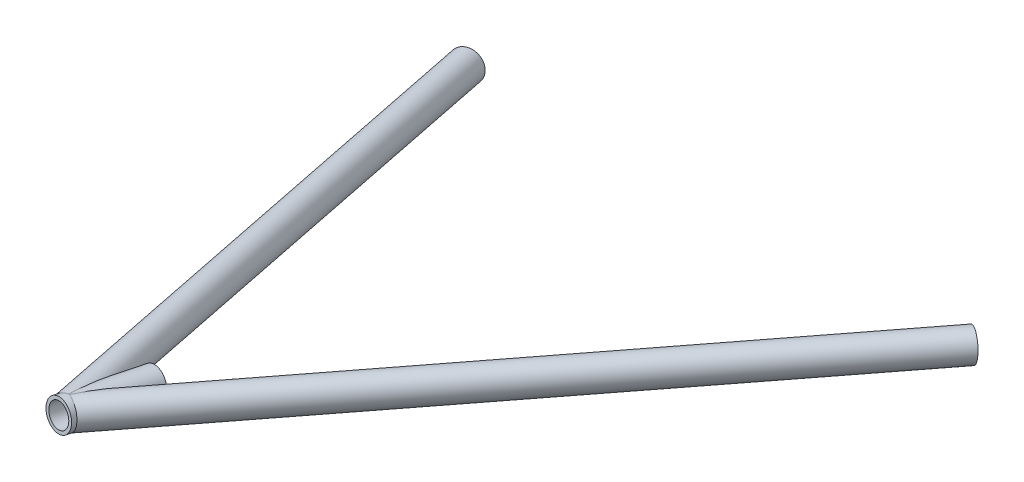
ISO-10303-21;
HEADER;
FILE_DESCRIPTION(('STEP AP214'),'2;1');
FILE_NAME('part.step','',(''),(''),'','','');
FILE_SCHEMA(('AUTOMOTIVE_DESIGN { 1 0 10303 214 1 1 1 1 }'));
ENDSEC;
DATA;
#1=APPLICATION_CONTEXT('core data for automotive mechanical design processes');
#2=APPLICATION_PROTOCOL_DEFINITION('international standard','automotive_design',2000,#1);
#3=PRODUCT_CONTEXT('',#1,'mechanical');
#4=PRODUCT('Part','Part','',(#3));
#5=PRODUCT_RELATED_PRODUCT_CATEGORY('part','',(#4));
#6=PRODUCT_DEFINITION_FORMATION('','',#4);
#7=PRODUCT_DEFINITION_CONTEXT('part definition',#1,'design');
#8=PRODUCT_DEFINITION('design','',#6,#7);
#9=PRODUCT_DEFINITION_SHAPE('','',#8);
#10=(LENGTH_UNIT() NAMED_UNIT(*) SI_UNIT(.MILLI.,.METRE.));
#11=(NAMED_UNIT(*) PLANE_ANGLE_UNIT() SI_UNIT($,.RADIAN.));
#12=(NAMED_UNIT(*) SI_UNIT($,.STERADIAN.) SOLID_ANGLE_UNIT());
#13=UNCERTAINTY_MEASURE_WITH_UNIT(LENGTH_MEASURE(1.E-05),#10,'distance_accuracy_value','');
#14=(GEOMETRIC_REPRESENTATION_CONTEXT(3) GLOBAL_UNCERTAINTY_ASSIGNED_CONTEXT((#13)) GLOBAL_UNIT_ASSIGNED_CONTEXT((#10,
#11,#12)) REPRESENTATION_CONTEXT('',''));
#15=CARTESIAN_POINT('',(0.,0.,0.));
#16=DIRECTION('',(0.,0.,1.));
#17=DIRECTION('',(1.,0.,0.));
#18=AXIS2_PLACEMENT_3D('',#15,#16,#17);
#19=CARTESIAN_POINT('',(1713.17260085528,131.13395858879,611.724588998966));
#20=DIRECTION('',(0.512976736373104,-0.08229223970805,-0.854448860508241));
#21=DIRECTION('',(-0.857356807637054,0.,-0.514722550893585));
#22=AXIS2_PLACEMENT_3D('',#19,#20,#21);
#23=CYLINDRICAL_SURFACE('',#22,7.41679999999994);
#24=CARTESIAN_POINT('',(1932.04581422694,96.022099388704,247.154513007892));
#25=DIRECTION('',(-0.512976736373104,0.0822922397080499,0.854448860508241));
#26=DIRECTION('',(0.857356807637054,0.,0.514722550893586));
#27=AXIS2_PLACEMENT_3D('',#24,#25,#26);
#28=CIRCLE('',#27,7.41679999999994);
#29=CARTESIAN_POINT('',(1938.40465819782,96.022099388704,250.972107223359));
#30=VERTEX_POINT('',#29);
#31=EDGE_CURVE('E107',#30,#30,#28,.T.);
#32=ORIENTED_EDGE('',*,*,#31,.F.);
#33=EDGE_LOOP('',(#32));
#34=FACE_BOUND('',#33,.T.);
#35=CARTESIAN_POINT('',(1727.96494727041,127.740863530205,572.676136847325));
#36=CARTESIAN_POINT('',(1727.97409356128,127.64516894431,572.660902269402));
#37=CARTESIAN_POINT('',(1727.98103211846,127.548097206245,572.652833381433));
#38=CARTESIAN_POINT('',(1727.98986205941,127.353714048548,572.652650921007));
#39=CARTESIAN_POINT('',(1727.9917570845,127.256402852634,572.660525830246));
#40=CARTESIAN_POINT('',(1727.9903865827,127.064536165254,572.692160774698));
#41=CARTESIAN_POINT('',(1727.98712459409,126.96997882967,572.715909912043));
#42=CARTESIAN_POINT('',(1727.97590682349,126.785874735888,572.777508555146));
#43=CARTESIAN_POINT('',(1727.96794614816,126.69633330799,572.81537274554));
#44=CARTESIAN_POINT('',(1727.94374603927,126.485559074002,572.921757086013));
#45=CARTESIAN_POINT('',(1727.92540545642,126.367705556888,572.996436012294));
#46=CARTESIAN_POINT('',(1727.88298827099,126.145253912992,573.162093992202));
#47=CARTESIAN_POINT('',(1727.85889597553,126.040693271732,573.253117468602));
#48=CARTESIAN_POINT('',(1727.80874896439,125.850776346686,573.438738015154));
#49=CARTESIAN_POINT('',(1727.78297627403,125.764568317802,573.532557144889));
#50=CARTESIAN_POINT('',(1727.72900511059,125.600664094481,573.726773439114));
#51=CARTESIAN_POINT('',(1727.70080438425,125.522975962023,573.827176692751));
#52=CARTESIAN_POINT('',(1727.64258111377,125.374671581661,574.032881151348));
#53=CARTESIAN_POINT('',(1727.61255461953,125.304071611508,574.138192852058));
#54=CARTESIAN_POINT('',(1727.55119302126,125.169051291257,574.352237356395));
#55=CARTESIAN_POINT('',(1727.51985847234,125.10462835719,574.460968704016));
#56=CARTESIAN_POINT('',(1727.43550937838,124.940862556696,574.75250380522));
#57=CARTESIAN_POINT('',(1727.38162646562,124.846001418485,574.937569357596));
#58=CARTESIAN_POINT('',(1727.2720160663,124.667387845638,575.312498085115));
#59=CARTESIAN_POINT('',(1727.21628751957,124.583641939115,575.502364002333));
#60=CARTESIAN_POINT('',(1727.10344674438,124.42503329062,575.885807049649));
#61=CARTESIAN_POINT('',(1727.04633202635,124.350188215227,576.079390703019));
#62=CARTESIAN_POINT('',(1726.93118633598,124.208006874476,576.469032465374));
#63=CARTESIAN_POINT('',(1726.87315525579,124.140671500554,576.665090865056));
#64=CARTESIAN_POINT('',(1726.75607151227,124.011958347827,577.060302103558));
#65=CARTESIAN_POINT('',(1726.69701473252,123.950620396564,577.259466620516));
#66=CARTESIAN_POINT('',(1726.57842016781,123.833477246945,577.659275794955));
#67=CARTESIAN_POINT('',(1726.51888236167,123.777672293717,577.859920517589));
#68=CARTESIAN_POINT('',(1726.39955647189,123.670971354545,578.262089610324));
#69=CARTESIAN_POINT('',(1726.33976888635,123.620068255865,578.463612248458));
#70=CARTESIAN_POINT('',(1726.21996664204,123.522526106761,578.867609532447));
#71=CARTESIAN_POINT('',(1726.15995198776,123.475886972416,579.070084159484));
#72=CARTESIAN_POINT('',(1725.97675549558,123.339471254847,579.68863525574));
#73=CARTESIAN_POINT('',(1725.8533478987,123.255762125754,580.105988788057));
#74=CARTESIAN_POINT('',(1725.60651921912,123.101361297342,580.943114963038));
#75=CARTESIAN_POINT('',(1725.48309813691,123.030671398123,581.362887931962));
#76=CARTESIAN_POINT('',(1725.23663397589,122.900298304971,582.204465381431));
#77=CARTESIAN_POINT('',(1725.11359110923,122.840620461465,582.626270747865));
#78=CARTESIAN_POINT('',(1724.86832131163,122.730861979163,583.471367521118));
#79=CARTESIAN_POINT('',(1724.74609440437,122.680781617954,583.894658970559));
#80=CARTESIAN_POINT('',(1724.5023773004,122.58898911596,584.744026957329));
#81=CARTESIAN_POINT('',(1724.38089135839,122.547307849537,585.170108032062));
#82=CARTESIAN_POINT('',(1724.13946845727,122.471741006267,586.023400168488));
#83=CARTESIAN_POINT('',(1724.01953151574,122.437855517866,586.450611242946));
#84=CARTESIAN_POINT('',(1723.78164336913,122.37730603995,587.305929188253));
#85=CARTESIAN_POINT('',(1723.66369146931,122.350639472405,587.734035684142));
#86=CARTESIAN_POINT('',(1723.43017032018,122.304100261973,588.591265690762));
#87=CARTESIAN_POINT('',(1723.31460107086,122.284227619046,589.020389201487));
#88=CARTESIAN_POINT('',(1723.08650301183,122.251038204343,589.879111158263));
#89=CARTESIAN_POINT('',(1722.97397051875,122.237713118719,590.308708304211));
#90=CARTESIAN_POINT('',(1722.75240223065,122.21746804288,591.168958885652));
#91=CARTESIAN_POINT('',(1722.6433664605,122.210548098208,591.599612328634));
#92=CARTESIAN_POINT('',(1722.4294841374,122.203151370928,592.462242442208));
#93=CARTESIAN_POINT('',(1722.32463967907,122.202677770736,592.894219661074));
#94=CARTESIAN_POINT('',(1722.12012673583,122.208397768749,593.759351670043));
#95=CARTESIAN_POINT('',(1722.02045816112,122.214591251234,594.192506439578));
#96=CARTESIAN_POINT('',(1721.82784497984,122.234044047694,595.058398596565));
#97=CARTESIAN_POINT('',(1721.73487583636,122.247275914712,595.49113110808));
#98=CARTESIAN_POINT('',(1721.55672743593,122.281510622887,596.357943907328));
#99=CARTESIAN_POINT('',(1721.47154880266,122.302514085519,596.792024300095));
#100=CARTESIAN_POINT('',(1721.31101479407,122.35340281984,597.661126705699));
#101=CARTESIAN_POINT('',(1721.23565138308,122.383280759445,598.096147648058));
#102=CARTESIAN_POINT('',(1721.09725075453,122.453629781079,598.967260132079));
#103=CARTESIAN_POINT('',(1721.03421072045,122.49409843764,599.40335140599));
#104=CARTESIAN_POINT('',(1720.95141843917,122.564800761776,600.058504181435));
#105=CARTESIAN_POINT('',(1720.92575512113,122.590076478741,600.27735975769));
#106=CARTESIAN_POINT('',(1720.87894799292,122.644429538069,600.715097811308));
#107=CARTESIAN_POINT('',(1720.85780430852,122.673506986186,600.933980289252));
#108=CARTESIAN_POINT('',(1720.82063639031,122.736046756599,601.37177018042));
#109=CARTESIAN_POINT('',(1720.80461691278,122.769513112292,601.590677429229));
#110=CARTESIAN_POINT('',(1720.77843177853,122.841500800809,602.0280190367));
#111=CARTESIAN_POINT('',(1720.76826600443,122.880022032265,602.246453404756));
#112=CARTESIAN_POINT('',(1720.75464236975,122.962578180945,602.680391994006));
#113=CARTESIAN_POINT('',(1720.75112283815,123.006558329871,602.895904544071));
#114=CARTESIAN_POINT('',(1720.75144146033,123.101309930987,603.32547198744));
#115=CARTESIAN_POINT('',(1720.75528034475,123.152082057095,603.539526733878));
#116=CARTESIAN_POINT('',(1720.77117314224,123.261516067903,603.964991352626));
#117=CARTESIAN_POINT('',(1720.78321484223,123.320166119178,604.176404681827));
#118=CARTESIAN_POINT('',(1720.81632130453,123.44675439699,604.595673975282));
#119=CARTESIAN_POINT('',(1720.83738269157,123.514689142633,604.803531240023));
#120=CARTESIAN_POINT('',(1720.88654176997,123.653870902915,605.193228073523));
#121=CARTESIAN_POINT('',(1720.91370135907,123.724071338384,605.375557052368));
#122=CARTESIAN_POINT('',(1720.97607889913,123.874300330305,605.734729463356));
#123=CARTESIAN_POINT('',(1721.01129627704,123.954328187649,605.911573284585));
#124=CARTESIAN_POINT('',(1721.08971062154,124.125271923741,606.258131687802));
#125=CARTESIAN_POINT('',(1721.13290784645,124.216188154927,606.427846038781));
#126=CARTESIAN_POINT('',(1721.22674446288,124.409769775465,606.758314823208));
#127=CARTESIAN_POINT('',(1721.27738376908,124.512435030114,606.919069359348));
#128=CARTESIAN_POINT('',(1721.3855072529,124.730994984514,607.23111948081));
#129=CARTESIAN_POINT('',(1721.44304636173,124.846995500896,607.382322217059));
#130=CARTESIAN_POINT('',(1721.56300771482,125.091639689068,607.67205382739));
#131=CARTESIAN_POINT('',(1721.62542999899,125.220283464155,607.810582597906));
#132=CARTESIAN_POINT('',(1721.75315143352,125.489914923755,608.073651978261));
#133=CARTESIAN_POINT('',(1721.81845111264,125.630904881767,608.19819000208));
#134=CARTESIAN_POINT('',(1721.94968124855,125.924479370239,608.432366170017));
#135=CARTESIAN_POINT('',(1722.01561167772,126.077063394983,608.542004963434));
#136=CARTESIAN_POINT('',(1722.13955526978,126.377509450479,608.736096590528));
#137=CARTESIAN_POINT('',(1722.19771779669,126.524402700009,608.821959461154));
#138=CARTESIAN_POINT('',(1722.31116511023,126.825880386425,608.981134975396));
#139=CARTESIAN_POINT('',(1722.3664501127,126.980464244723,609.054448561295));
#140=CARTESIAN_POINT('',(1722.47275540199,127.296365032461,609.188669150145));
#141=CARTESIAN_POINT('',(1722.5237749461,127.457683127195,609.249573995075));
#142=CARTESIAN_POINT('',(1722.62033165225,127.785999443879,609.359205215786));
#143=CARTESIAN_POINT('',(1722.66586857487,127.952997913477,609.407931059826));
#144=CARTESIAN_POINT('',(1722.75164172524,128.29640418743,609.494706477049));
#145=CARTESIAN_POINT('',(1722.79169181994,128.472944530114,609.532415478967));
#146=CARTESIAN_POINT('',(1722.8640371505,128.829759443344,609.595601504443));
#147=CARTESIAN_POINT('',(1722.89633232043,129.010034045622,609.621078424016));
#148=CARTESIAN_POINT('',(1722.95249148233,129.373186473069,609.660119630804));
#149=CARTESIAN_POINT('',(1722.97635454316,129.556064583422,609.673682602619));
#150=CARTESIAN_POINT('',(1723.01515818182,129.923256038395,609.689169544628));
#151=CARTESIAN_POINT('',(1723.03009848552,130.107569426933,609.691093157246));
#152=CARTESIAN_POINT('',(1723.05126111044,130.48562374927,609.68334006981));
#153=CARTESIAN_POINT('',(1723.05701489795,130.679379398514,609.673083994552));
#154=CARTESIAN_POINT('',(1723.05820730972,131.065873045047,609.640194907813));
#155=CARTESIAN_POINT('',(1723.05364558616,131.258611007804,609.617561479028));
#156=CARTESIAN_POINT('',(1723.0342649561,131.641770012805,609.560034321559));
#157=CARTESIAN_POINT('',(1723.01944390483,131.832190562108,609.525138030002));
#158=CARTESIAN_POINT('',(1722.97981103516,132.209328386555,609.443138314178));
#159=CARTESIAN_POINT('',(1722.95499922456,132.39604566459,609.396034899443));
#160=CARTESIAN_POINT('',(1722.89550269088,132.766703219176,609.288949001972));
#161=CARTESIAN_POINT('',(1722.86069983807,132.950580734236,609.22881466779));
#162=CARTESIAN_POINT('',(1722.78208849335,133.311748866658,609.095948257574));
#163=CARTESIAN_POINT('',(1722.73827986116,133.489039381357,609.023215985292));
#164=CARTESIAN_POINT('',(1722.64265698482,133.83559948493,608.865054832965));
#165=CARTESIAN_POINT('',(1722.59084362106,134.004869953218,608.779627349244));
#166=CARTESIAN_POINT('',(1722.48047464414,134.33400566275,608.595962018572));
#167=CARTESIAN_POINT('',(1722.4219192384,134.493871193108,608.497724565708));
#168=CARTESIAN_POINT('',(1722.30106472921,134.799174643532,608.290864804495));
#169=CARTESIAN_POINT('',(1722.23888720345,134.94486466322,608.18254370868));
#170=CARTESIAN_POINT('',(1722.11127512067,135.224795212031,607.953702361441));
#171=CARTESIAN_POINT('',(1722.04584064459,135.359036025404,607.833182413039));
#172=CARTESIAN_POINT('',(1721.91366635636,135.614930784771,607.580298333684));
#173=CARTESIAN_POINT('',(1721.84692756972,135.736594180956,607.447943236731));
#174=CARTESIAN_POINT('',(1721.71412450417,135.966639285091,607.171847178467));
#175=CARTESIAN_POINT('',(1721.64806018694,136.075021751086,607.02810686777));
#176=CARTESIAN_POINT('',(1721.52239851466,136.272116972746,606.738790542243));
#177=CARTESIAN_POINT('',(1721.46264865977,136.361607971169,606.593809785904));
#178=CARTESIAN_POINT('',(1721.34708030177,136.528344058238,606.295479899512));
#179=CARTESIAN_POINT('',(1721.29126195926,136.605588646783,606.142130428052));
#180=CARTESIAN_POINT('',(1721.18487097998,136.748087082032,605.828289022178));
#181=CARTESIAN_POINT('',(1721.1342967204,136.813344643017,605.667799319437));
#182=CARTESIAN_POINT('',(1721.0393136034,136.93250954249,605.340898347557));
#183=CARTESIAN_POINT('',(1720.99490558263,136.986415341279,605.174486278711));
#184=CARTESIAN_POINT('',(1720.89775755889,137.101612192386,604.774949400739));
#185=CARTESIAN_POINT('',(1720.84795468422,137.158334953547,604.539786197404));
#186=CARTESIAN_POINT('',(1720.761417646,137.254742564386,604.063646261449));
#187=CARTESIAN_POINT('',(1720.72468903258,137.294420179742,603.822667106151));
#188=CARTESIAN_POINT('',(1720.66371663303,137.359538683433,603.336541202226));
#189=CARTESIAN_POINT('',(1720.63951103582,137.384936044358,603.091384033362));
#190=CARTESIAN_POINT('',(1720.60272339149,137.423819425911,602.599355883453));
#191=CARTESIAN_POINT('',(1720.59013996661,137.437306858397,602.352485109045));
#192=CARTESIAN_POINT('',(1720.57337385512,137.456823568455,601.792628043288));
#193=CARTESIAN_POINT('',(1720.57230027565,137.459930016163,601.479454378519));
#194=CARTESIAN_POINT('',(1720.58417742968,137.454018409565,600.853430304954));
#195=CARTESIAN_POINT('',(1720.59713493855,137.444994497211,600.540580125412));
#196=CARTESIAN_POINT('',(1720.63480918709,137.417352784856,599.915485161843));
#197=CARTESIAN_POINT('',(1720.65954724853,137.398717584163,599.603242510398));
#198=CARTESIAN_POINT('',(1720.71882165563,137.353738420371,598.980328897369));
#199=CARTESIAN_POINT('',(1720.75335646173,137.327395668486,598.669657696635));
#200=CARTESIAN_POINT('',(1720.8308046662,137.268223698417,598.048368225909));
#201=CARTESIAN_POINT('',(1720.87376015575,137.235361884093,597.737758410564));
#202=CARTESIAN_POINT('',(1720.96659709961,137.164253235441,597.118199275331));
#203=CARTESIAN_POINT('',(1721.01647876114,137.126006240001,596.80925000541));
#204=CARTESIAN_POINT('',(1721.12202554296,137.04490868398,596.193280763136));
#205=CARTESIAN_POINT('',(1721.17768482224,137.002062771319,595.886259168724));
#206=CARTESIAN_POINT('',(1721.29394637719,136.91227202674,595.273753004626));
#207=CARTESIAN_POINT('',(1721.35454879116,136.86532708014,594.968268478198));
#208=CARTESIAN_POINT('',(1721.48689814169,136.762340022273,594.325092282613));
#209=CARTESIAN_POINT('',(1721.55913661087,136.705865864814,593.987571240588));
#210=CARTESIAN_POINT('',(1721.70800797088,136.588721327278,593.314235690565));
#211=CARTESIAN_POINT('',(1721.78464089753,136.528050913001,592.978421196498));
#212=CARTESIAN_POINT('',(1722.02015110959,136.340118035014,591.973243681679));
#213=CARTESIAN_POINT('',(1722.18461125852,136.206955959258,591.306282617483));
#214=CARTESIAN_POINT('',(1722.52380469313,135.926387101613,589.980768374029));
#215=CARTESIAN_POINT('',(1722.69849782608,135.779034703202,589.322193249398));
#216=CARTESIAN_POINT('',(1723.05598721481,135.469567694324,588.01080760164));
#217=CARTESIAN_POINT('',(1723.23878260921,135.307454651191,587.357996474529));
#218=CARTESIAN_POINT('',(1723.55452426619,135.018691715748,586.253930224215));
#219=CARTESIAN_POINT('',(1723.68590746506,134.896061424993,585.801171825454));
#220=CARTESIAN_POINT('',(1723.95111551043,134.642547833543,584.898691759351));
#221=CARTESIAN_POINT('',(1724.08494031998,134.511664657721,584.448970046175));
#222=CARTESIAN_POINT('',(1724.35467562746,134.240717304903,583.552415100005));
#223=CARTESIAN_POINT('',(1724.49058800813,134.100644416195,583.105585062221));
#224=CARTESIAN_POINT('',(1724.76392276377,133.810333225487,582.215709012982));
#225=CARTESIAN_POINT('',(1724.90134507992,133.660095318334,581.772662855299));
#226=CARTESIAN_POINT('',(1725.13303411532,133.39795288106,581.032344486458));
#227=CARTESIAN_POINT('',(1725.22701445816,133.28919715999,580.733866737919));
#228=CARTESIAN_POINT('',(1725.41531632578,133.065645250542,580.139292497245));
#229=CARTESIAN_POINT('',(1725.50963784152,132.95084922093,579.843195942756));
#230=CARTESIAN_POINT('',(1725.69835005293,132.714542685856,579.25412563389));
#231=CARTESIAN_POINT('',(1725.79274055542,132.593039779193,578.961148776507));
#232=CARTESIAN_POINT('',(1725.98149054865,132.342170423669,578.378573935822));
#233=CARTESIAN_POINT('',(1726.07585004089,132.212804440137,578.088975753778));
#234=CARTESIAN_POINT('',(1726.23385918959,131.988073989553,577.606814129099));
#235=CARTESIAN_POINT('',(1726.29758828677,131.895216124959,577.413108274243));
#236=CARTESIAN_POINT('',(1726.4248037404,131.704690541732,577.027999567039));
#237=CARTESIAN_POINT('',(1726.48829010775,131.607023041657,576.836596610536));
#238=CARTESIAN_POINT('',(1726.61505615117,131.405902201767,576.456054624089));
#239=CARTESIAN_POINT('',(1726.67833480281,131.302433918203,576.266923123393));
#240=CARTESIAN_POINT('',(1726.80431567271,131.089057563296,575.892150690148));
#241=CARTESIAN_POINT('',(1726.867017965,130.979150332607,575.706509306099));
#242=CARTESIAN_POINT('',(1726.99211645082,130.750728030525,575.338096019851));
#243=CARTESIAN_POINT('',(1727.05450552396,130.632147790679,575.155361869542));
#244=CARTESIAN_POINT('',(1727.17801168559,130.385601539973,574.795908283368));
#245=CARTESIAN_POINT('',(1727.23912910397,130.257638003225,574.619187279869));
#246=CARTESIAN_POINT('',(1727.35926148651,129.990467359075,574.274593833891));
#247=CARTESIAN_POINT('',(1727.41828252617,129.851297354702,574.10669500518));
#248=CARTESIAN_POINT('',(1727.53327019244,129.558384804784,573.783152562983));
#249=CARTESIAN_POINT('',(1727.58924141535,129.404665200731,573.627490341884));
#250=CARTESIAN_POINT('',(1727.68314433537,129.117876197078,573.370777447723));
#251=CARTESIAN_POINT('',(1727.72215557023,128.988860016176,573.26564562207));
#252=CARTESIAN_POINT('',(1727.79564740224,128.717655455677,573.071767362935));
#253=CARTESIAN_POINT('',(1727.83013371945,128.575484101463,572.983000183799));
#254=CARTESIAN_POINT('',(1727.88309047912,128.318771701563,572.852247853479));
#255=CARTESIAN_POINT('',(1727.90333274577,128.20777788541,572.804131380463));
#256=CARTESIAN_POINT('',(1727.93851685935,127.978856234307,572.72565361665));
#257=CARTESIAN_POINT('',(1727.95347021606,127.860944115686,572.695253676343));
#258=CARTESIAN_POINT('',(1727.96494727041,127.740863530205,572.676136847325));
#259=B_SPLINE_CURVE_WITH_KNOTS('',3,(#35,#36,#37,#38,#39,#40,#41,#42,#43,#44,#45,#46,#47,#48,
#49,#50,#51,#52,#53,#54,#55,#56,#57,#58,#59,#60,#61,#62,#63,#64,#65,#66,#67,#68,#69,#70,#71,#72,
#73,#74,#75,#76,#77,#78,#79,#80,#81,#82,#83,#84,#85,#86,#87,#88,#89,#90,#91,#92,#93,#94,#95,#96,
#97,#98,#99,#100,#101,#102,#103,#104,#105,#106,#107,#108,#109,#110,#111,#112,#113,#114,#115,
#116,#117,#118,#119,#120,#121,#122,#123,#124,#125,#126,#127,#128,#129,#130,#131,#132,#133,#134,
#135,#136,#137,#138,#139,#140,#141,#142,#143,#144,#145,#146,#147,#148,#149,#150,#151,#152,#153,
#154,#155,#156,#157,#158,#159,#160,#161,#162,#163,#164,#165,#166,#167,#168,#169,#170,#171,#172,
#173,#174,#175,#176,#177,#178,#179,#180,#181,#182,#183,#184,#185,#186,#187,#188,#189,#190,#191,
#192,#193,#194,#195,#196,#197,#198,#199,#200,#201,#202,#203,#204,#205,#206,#207,#208,#209,#210,
#211,#212,#213,#214,#215,#216,#217,#218,#219,#220,#221,#222,#223,#224,#225,#226,#227,#228,#229,
#230,#231,#232,#233,#234,#235,#236,#237,#238,#239,#240,#241,#242,#243,#244,#245,#246,#247,#248,
#249,#250,#251,#252,#253,#254,#255,#256,#257,#258),.UNSPECIFIED.,.T.,.F.,(4,2,2,2,2,2,2,2,2,2,2,
2,2,2,2,2,2,2,2,2,2,2,2,2,2,2,2,2,2,2,2,2,2,2,2,2,2,2,2,2,2,2,2,2,2,2,2,2,2,2,2,2,2,2,2,2,2,2,2,
2,2,2,2,2,2,2,2,2,2,2,2,2,2,2,2,2,2,2,2,2,2,2,2,2,2,2,2,2,2,2,2,2,2,2,2,2,2,2,2,2,2,2,2,2,2,2,2,
2,2,2,2,4),(0.,0.291656591218855,0.583102555640827,0.87434864375699,1.16589858006724,
1.5856578834552,2.00657580956693,2.39597589617774,2.78574133110556,3.17638230524677,
3.56685914740464,4.21083369398615,4.85518479688032,5.50079420094327,6.14648016047722,
6.79619807535992,7.44594476172044,8.09473397282771,8.74351041212596,10.0728164311257,
11.4023061086014,12.7324400540744,14.0626124648872,15.3975886924638,16.7325800649132,
18.0670940527303,19.4016080328567,20.7344230889432,22.0672476221921,23.4007301175251,
24.7341894682326,26.0624865637217,27.390889902896,28.7181987552896,30.0452038952401,
30.7105409766526,31.3758965697791,32.0418679651432,32.7078260073738,33.3675736123946,
34.0273867279434,34.6862195967952,35.3448061388811,35.9361426842286,36.5274371870364,
37.1187508342409,37.7100577027442,38.306431067104,38.9028093042808,39.4992975940149,
40.0957598807923,40.6345779252884,41.1733554939511,41.712226682339,42.2511213940096,
42.8052431052792,43.3593695271133,43.913557121494,44.4677617411174,45.0494204713949,
45.6310988136173,46.2128987958999,46.7946983239421,47.3836820475387,47.9726749469791,
48.5616031119762,49.1505131634281,49.7254694740632,50.3004115060981,50.8749183599962,
51.4493924070681,51.9903845216299,52.5313987227882,53.0722450022913,53.6131645923983,
54.3529066416226,55.0929623436864,55.8352617360778,56.5774731210975,57.5163331156722,
58.4556466717029,59.3966668023599,60.3375391343051,61.2832402340867,62.2289696330675,
63.1737520684949,64.1185609450706,65.1677571232543,66.2169618530206,68.315793175217,
70.4068787946167,72.4977426342074,73.9590409263611,75.4203171128225,76.8829991637273,
78.3456244311909,79.3394232765677,80.3331960137288,81.3258650514062,82.3184754009144,
82.9906234829013,83.6627410495362,84.336677677075,85.0105265122617,85.6900973245055,
86.3694895928182,87.0467183255271,87.7228964646583,88.2348355184021,88.7461210498792,
89.1129041224166,89.4788840146468),.UNSPECIFIED.);
#260=CARTESIAN_POINT('',(1727.96494727041,127.740863530205,572.676136847325));
#261=VERTEX_POINT('',#260);
#262=EDGE_CURVE('E81',#261,#261,#259,.T.);
#263=ORIENTED_EDGE('',*,*,#262,.T.);
#264=EDGE_LOOP('',(#263));
#265=FACE_BOUND('',#264,.T.);
#266=ADVANCED_FACE('F63',(#34,#265),#23,.F.);
#267=CARTESIAN_POINT('',(1719.75176820433,126.102654339161,562.415355233465));
#268=DIRECTION('',(-0.131583346980973,0.100626084992588,0.98618467531003));
#269=DIRECTION('',(0.991215775128284,0.,0.132254629925897));
#270=AXIS2_PLACEMENT_3D('',#267,#268,#269);
#271=CYLINDRICAL_SURFACE('',#270,9.525);
#272=ORIENTED_EDGE('',*,*,#262,.F.);
#273=EDGE_LOOP('',(#272));
#274=FACE_BOUND('',#273,.T.);
#275=CARTESIAN_POINT('',(1713.17260085528,131.13395858879,611.724588998965));
#276=DIRECTION('',(0.944230002344393,0.0453897924229676,0.326143326493902));
#277=DIRECTION('',(0.329060742994004,-0.0933834430453637,-0.93968003064087));
#278=AXIS2_PLACEMENT_3D('',#275,#276,#277);
#279=ELLIPSE('',#278,47.1628036692756,9.52499999999997);
#280=CARTESIAN_POINT('',(1713.05643876749,140.607476372162,610.742452461864));
#281=VERTEX_POINT('',#280);
#282=CARTESIAN_POINT('',(1713.28876294306,121.660440805419,612.706725536066));
#283=VERTEX_POINT('',#282);
#284=EDGE_CURVE('E72',#281,#283,#279,.F.);
#285=ORIENTED_EDGE('',*,*,#284,.T.);
#286=CARTESIAN_POINT('',(1713.17260085528,131.13395858879,611.724588998965));
#287=DIRECTION('',(0.329060742994004,-0.0933834430453637,-0.93968003064087));
#288=DIRECTION('',(0.944230002344393,0.0453897924229676,0.326143326493902));
#289=AXIS2_PLACEMENT_3D('',#286,#287,#288);
#290=ELLIPSE('',#289,9.72540390868762,9.52499999999997);
#291=EDGE_CURVE('E13',#283,#281,#290,.F.);
#292=ORIENTED_EDGE('',*,*,#291,.T.);
#293=EDGE_LOOP('',(#285,#292));
#294=FACE_BOUND('',#293,.T.);
#295=ADVANCED_FACE('F79',(#274,#294),#271,.F.);
#296=CARTESIAN_POINT('',(1713.17260085528,131.13395858879,611.724588998966));
#297=DIRECTION('',(0.512976736373104,-0.08229223970805,-0.854448860508241));
#298=DIRECTION('',(-0.857356807637054,0.,-0.514722550893585));
#299=AXIS2_PLACEMENT_3D('',#296,#297,#298);
#300=CYLINDRICAL_SURFACE('',#299,9.52499999999993);
#301=CARTESIAN_POINT('',(1932.04581422694,96.022099388704,247.154513007892));
#302=DIRECTION('',(-0.512976736373104,0.0822922397080499,0.854448860508241));
#303=DIRECTION('',(0.857356807637054,0.,0.514722550893586));
#304=AXIS2_PLACEMENT_3D('',#301,#302,#303);
#305=CIRCLE('',#304,9.52499999999993);
#306=CARTESIAN_POINT('',(1940.21213781968,96.022099388704,252.057245305153));
#307=VERTEX_POINT('',#306);
#308=EDGE_CURVE('E67',#307,#307,#305,.T.);
#309=ORIENTED_EDGE('',*,*,#308,.T.);
#310=EDGE_LOOP('',(#309));
#311=FACE_BOUND('',#310,.T.);
#312=ORIENTED_EDGE('',*,*,#284,.F.);
#313=ORIENTED_EDGE('',*,*,#291,.F.);
#314=EDGE_LOOP('',(#312,#313));
#315=FACE_BOUND('',#314,.T.);
#316=ADVANCED_FACE('F65',(#311,#315),#300,.T.);
#317=CARTESIAN_POINT('',(1932.04581422694,96.022099388704,247.154513007892));
#318=DIRECTION('',(-0.512976736373104,0.0822922397080499,0.854448860508241));
#319=DIRECTION('',(0.857356807637054,0.,0.514722550893586));
#320=AXIS2_PLACEMENT_3D('',#317,#318,#319);
#321=PLANE('',#320);
#322=ORIENTED_EDGE('',*,*,#31,.T.);
#323=EDGE_LOOP('',(#322));
#324=FACE_BOUND('',#323,.T.);
#325=ORIENTED_EDGE('',*,*,#308,.F.);
#326=EDGE_LOOP('',(#325));
#327=FACE_BOUND('',#326,.T.);
#328=ADVANCED_FACE('F84',(#324,#327),#321,.F.);
#329=CLOSED_SHELL('',(#266,#295,#316,#328));
#330=MANIFOLD_SOLID_BREP('B2',#329);
#331=CARTESIAN_POINT('',(1600.,88.8502518080076,217.248802890104));
#332=DIRECTION('',(0.274316838299431,0.102490644096067,0.956162088820811));
#333=DIRECTION('',(0.961223924389069,0.,-0.275769046816492));
#334=AXIS2_PLACEMENT_3D('',#331,#332,#333);
#335=CYLINDRICAL_SURFACE('',#334,7.41679999999994);
#336=CARTESIAN_POINT('',(1609.60108934048,92.43742435137,250.714475998833));
#337=DIRECTION('',(0.274316838299431,0.102490644096068,0.956162088820811));
#338=DIRECTION('',(0.96122392438907,0.,-0.275769046816492));
#339=AXIS2_PLACEMENT_3D('',#336,#337,#338);
#340=CIRCLE('',#339,7.41679999999994);
#341=CARTESIAN_POINT('',(1616.73029494289,92.43742435137,248.669152132404));
#342=VERTEX_POINT('',#341);
#343=EDGE_CURVE('E161',#342,#342,#340,.T.);
#344=ORIENTED_EDGE('',*,*,#343,.F.);
#345=EDGE_LOOP('',(#344));
#346=FACE_BOUND('',#345,.T.);
#347=CARTESIAN_POINT('',(1709.06350498049,126.935088537342,570.506905601688));
#348=CARTESIAN_POINT('',(1709.06255294939,127.044087690915,570.503591947602));
#349=CARTESIAN_POINT('',(1709.06210544559,127.153423526844,570.510808036362));
#350=CARTESIAN_POINT('',(1709.06214305419,127.3691639084,570.544250855181));
#351=CARTESIAN_POINT('',(1709.06262991493,127.475562580256,570.570513166284));
#352=CARTESIAN_POINT('',(1709.06469977815,127.722014388532,570.65118024678));
#353=CARTESIAN_POINT('',(1709.06662456253,127.859776377144,570.712435957904));
#354=CARTESIAN_POINT('',(1709.07149010629,128.124282710594,570.855157677084));
#355=CARTESIAN_POINT('',(1709.07443334234,128.25099924581,570.936672814765));
#356=CARTESIAN_POINT('',(1709.08087011885,128.489175845386,571.109810217326));
#357=CARTESIAN_POINT('',(1709.08433587729,128.601050069092,571.200875292237));
#358=CARTESIAN_POINT('',(1709.09170794719,128.816794076298,571.39210633078));
#359=CARTESIAN_POINT('',(1709.09561469405,128.92065577575,571.492281269256));
#360=CARTESIAN_POINT('',(1709.10374410881,129.121738028066,571.699507529599));
#361=CARTESIAN_POINT('',(1709.10796755147,129.218941102107,571.806575618093));
#362=CARTESIAN_POINT('',(1709.11662832225,129.407398445323,572.025690068846));
#363=CARTESIAN_POINT('',(1709.12106555107,129.498655430406,572.137734118419));
#364=CARTESIAN_POINT('',(1709.13335362214,129.740336974716,572.448175424802));
#365=CARTESIAN_POINT('',(1709.14135208081,129.885813797925,572.650413238847));
#366=CARTESIAN_POINT('',(1709.15757186825,130.165104494953,573.062833072702));
#367=CARTESIAN_POINT('',(1709.16579332973,130.298911214796,573.273019853764));
#368=CARTESIAN_POINT('',(1709.18233172725,130.557271722533,573.699539466838));
#369=CARTESIAN_POINT('',(1709.19064881981,130.681806711654,573.915883618693));
#370=CARTESIAN_POINT('',(1709.20726295485,130.922971223934,574.352940978976));
#371=CARTESIAN_POINT('',(1709.21555999488,131.039599817308,574.573654697332));
#372=CARTESIAN_POINT('',(1709.23209942495,131.266716282858,575.01961346927));
#373=CARTESIAN_POINT('',(1709.24034132774,131.377170187306,575.244875771922));
#374=CARTESIAN_POINT('',(1709.25666645807,131.59223568389,575.698181111083));
#375=CARTESIAN_POINT('',(1709.26474967823,131.69684700532,575.926224275844));
#376=CARTESIAN_POINT('',(1709.28069399071,131.900815623402,576.384294277709));
#377=CARTESIAN_POINT('',(1709.28855535839,132.000179579784,576.614318147394));
#378=CARTESIAN_POINT('',(1709.30401965397,132.194371047811,577.076274498432));
#379=CARTESIAN_POINT('',(1709.31162258369,132.28919859116,577.308206966433));
#380=CARTESIAN_POINT('',(1709.32889964164,132.504344048182,577.847839342296));
#381=CARTESIAN_POINT('',(1709.33846211915,132.623160254534,578.156141633026));
#382=CARTESIAN_POINT('',(1709.35696306721,132.854561437848,578.77509907653));
#383=CARTESIAN_POINT('',(1709.3659015102,132.967146139598,579.085754332533));
#384=CARTESIAN_POINT('',(1709.39163720804,133.296602206956,580.020778766972));
#385=CARTESIAN_POINT('',(1709.4073520924,133.505142480247,580.64812250019));
#386=CARTESIAN_POINT('',(1709.43506389014,133.904010408966,581.909510342598));
#387=CARTESIAN_POINT('',(1709.44705587271,134.09431368178,582.543562197447));
#388=CARTESIAN_POINT('',(1709.46627478986,134.458749251554,583.816297644709));
#389=CARTESIAN_POINT('',(1709.47350215179,134.632882997559,584.454980816541));
#390=CARTESIAN_POINT('',(1709.48189036759,134.965916585917,585.734068648147));
#391=CARTESIAN_POINT('',(1709.48307133795,135.124865214895,586.374460497877));
#392=CARTESIAN_POINT('',(1709.47774464217,135.428924112687,587.658539990947));
#393=CARTESIAN_POINT('',(1709.47123646437,135.574033459913,588.302227850771));
#394=CARTESIAN_POINT('',(1709.44826322381,135.850293853537,589.59179398585));
#395=CARTESIAN_POINT('',(1709.43180751393,135.981457875596,590.237669637556));
#396=CARTESIAN_POINT('',(1709.38580003499,136.22915818263,591.531712589971));
#397=CARTESIAN_POINT('',(1709.35625007072,136.345696480639,592.179879562657));
#398=CARTESIAN_POINT('',(1709.29081179958,136.530079213882,593.286166942272));
#399=CARTESIAN_POINT('',(1709.25937726659,136.602136122396,593.743844087317));
#400=CARTESIAN_POINT('',(1709.1854876718,136.736619824262,594.659832719665));
#401=CARTESIAN_POINT('',(1709.14303066,136.79904491052,595.118144304924));
#402=CARTESIAN_POINT('',(1709.04416569582,136.912213467283,596.034978200336));
#403=CARTESIAN_POINT('',(1708.9877522148,136.962952293032,596.493500521948));
#404=CARTESIAN_POINT('',(1708.88975099101,137.027744884094,597.180391632134));
#405=CARTESIAN_POINT('',(1708.85485739247,137.047455241833,597.409186600545));
#406=CARTESIAN_POINT('',(1708.77999936976,137.082498542064,597.866275824807));
#407=CARTESIAN_POINT('',(1708.74003522767,137.0978317279,598.094570107792));
#408=CARTESIAN_POINT('',(1708.64036473044,137.127579178516,598.624903221333));
#409=CARTESIAN_POINT('',(1708.57847544494,137.140054340062,598.9266517696));
#410=CARTESIAN_POINT('',(1708.44281982156,137.153788818515,599.527835169082));
#411=CARTESIAN_POINT('',(1708.36905158462,137.155046340267,599.827269642315));
#412=CARTESIAN_POINT('',(1708.20791333706,137.143338259056,600.421624012675));
#413=CARTESIAN_POINT('',(1708.12057027134,137.130400530668,600.716551608552));
#414=CARTESIAN_POINT('',(1707.93044339718,137.086441312372,601.300025221551));
#415=CARTESIAN_POINT('',(1707.82766804035,137.055429694152,601.588574633115));
#416=CARTESIAN_POINT('',(1707.64328569579,136.984920253529,602.059749571055));
#417=CARTESIAN_POINT('',(1707.56629997066,136.951854799591,602.245148247322));
#418=CARTESIAN_POINT('',(1707.4052274429,136.874200624648,602.610338700682));
#419=CARTESIAN_POINT('',(1707.32114311375,136.82961590643,602.790132401155));
#420=CARTESIAN_POINT('',(1707.14643921547,136.727474374723,603.14251328874));
#421=CARTESIAN_POINT('',(1707.05582669949,136.66993142272,603.315107944583));
#422=CARTESIAN_POINT('',(1706.86903107642,136.540530396036,603.65174228537));
#423=CARTESIAN_POINT('',(1706.77284809823,136.46867265249,603.815782168095));
#424=CARTESIAN_POINT('',(1706.5755691397,136.308905103992,604.135399092814));
#425=CARTESIAN_POINT('',(1706.47443409809,136.220844157524,604.290876859844));
#426=CARTESIAN_POINT('',(1706.27034599279,136.02870216644,604.590343745205));
#427=CARTESIAN_POINT('',(1706.16739288982,135.924620775313,604.734332614937));
#428=CARTESIAN_POINT('',(1705.96217949654,135.700549717034,605.010023955433));
#429=CARTESIAN_POINT('',(1705.85991950627,135.580553572027,605.141721385769));
#430=CARTESIAN_POINT('',(1705.65878423169,135.325394362455,605.392374978266));
#431=CARTESIAN_POINT('',(1705.55990871974,135.190232320627,605.511331998542));
#432=CARTESIAN_POINT('',(1705.38006379439,134.923688800436,605.722439684072));
#433=CARTESIAN_POINT('',(1705.29840156879,134.793948948376,605.81608221586));
#434=CARTESIAN_POINT('',(1705.14109921915,134.524689527066,605.993845043834));
#435=CARTESIAN_POINT('',(1705.06545846979,134.385170976182,606.077966329197));
#436=CARTESIAN_POINT('',(1704.92149674826,134.097377315959,606.237002091626));
#437=CARTESIAN_POINT('',(1704.8531763516,133.949101519578,606.311915844898));
#438=CARTESIAN_POINT('',(1704.72495538455,133.644889031478,606.45287565571));
#439=CARTESIAN_POINT('',(1704.66505525417,133.488951940001,606.518921249846));
#440=CARTESIAN_POINT('',(1704.55276314968,133.165313822753,606.64449799809));
#441=CARTESIAN_POINT('',(1704.50068152781,132.997394751521,606.703744763815));
#442=CARTESIAN_POINT('',(1704.40723664502,132.655804601361,606.813444535391));
#443=CARTESIAN_POINT('',(1704.36587349178,132.482133464666,606.863897452896));
#444=CARTESIAN_POINT('',(1704.29444518128,132.130233332398,606.956255522036));
#445=CARTESIAN_POINT('',(1704.26438136299,131.952003799328,606.998159660377));
#446=CARTESIAN_POINT('',(1704.2159669121,131.592205916582,607.073563971884));
#447=CARTESIAN_POINT('',(1704.19761662898,131.410637467454,607.107063894284));
#448=CARTESIAN_POINT('',(1704.17227296706,131.036406309847,607.167148495296));
#449=CARTESIAN_POINT('',(1704.16587915398,130.843635429563,607.193314654517));
#450=CARTESIAN_POINT('',(1704.16635844258,130.457075704539,607.236401786006));
#451=CARTESIAN_POINT('',(1704.17323199085,130.263286825751,607.253322447048));
#452=CARTESIAN_POINT('',(1704.20017135363,129.875988768252,607.277739229447));
#453=CARTESIAN_POINT('',(1704.22024000917,129.682479658771,607.285233320164));
#454=CARTESIAN_POINT('',(1704.27331027896,129.297108939081,607.29048561702));
#455=CARTESIAN_POINT('',(1704.30631187309,129.105247326308,607.288243838313));
#456=CARTESIAN_POINT('',(1704.38523499487,128.722342660874,607.273517323067));
#457=CARTESIAN_POINT('',(1704.43129750427,128.531333019112,607.26091779662));
#458=CARTESIAN_POINT('',(1704.53549747284,128.153685587694,607.224772132334));
#459=CARTESIAN_POINT('',(1704.59363511356,127.96704786382,607.201225829895));
#460=CARTESIAN_POINT('',(1704.72104946367,127.599506580854,607.142534461137));
#461=CARTESIAN_POINT('',(1704.79032473449,127.418602284821,607.107390892143));
#462=CARTESIAN_POINT('',(1704.93882518666,127.063823418233,607.024782512783));
#463=CARTESIAN_POINT('',(1705.01805004685,126.889948621015,606.977318100063));
#464=CARTESIAN_POINT('',(1705.18287133706,126.554762366878,606.870691219666));
#465=CARTESIAN_POINT('',(1705.26825828047,126.393245243743,606.811851796874));
#466=CARTESIAN_POINT('',(1705.44542502317,126.079227406208,606.681158360164));
#467=CARTESIAN_POINT('',(1705.53720465223,125.926726451922,606.609304692711));
#468=CARTESIAN_POINT('',(1705.72517829115,125.631858842532,606.452205164979));
#469=CARTESIAN_POINT('',(1705.82136882273,125.489484420571,606.36696973277));
#470=CARTESIAN_POINT('',(1706.01613272043,125.215562681061,606.182914845776));
#471=CARTESIAN_POINT('',(1706.11470594918,125.084014741268,606.084096172551));
#472=CARTESIAN_POINT('',(1706.30618175788,124.839797347056,605.87940332063));
#473=CARTESIAN_POINT('',(1706.39907209121,124.726469977745,605.774300884838));
#474=CARTESIAN_POINT('',(1706.58332028324,124.510039632734,605.552827699452));
#475=CARTESIAN_POINT('',(1706.67467807381,124.406937110559,605.436456450479));
#476=CARTESIAN_POINT('',(1706.85430093581,124.210877594437,605.19333907854));
#477=CARTESIAN_POINT('',(1706.94256682025,124.117917919628,605.066595712607));
#478=CARTESIAN_POINT('',(1707.11481991827,123.94171167141,604.803801170684));
#479=CARTESIAN_POINT('',(1707.1988065434,123.858466431849,604.667748720562));
#480=CARTESIAN_POINT('',(1707.39268452482,123.671050474943,604.334099849375));
#481=CARTESIAN_POINT('',(1707.50024058683,123.571006080347,604.132819525696));
#482=CARTESIAN_POINT('',(1707.70435280422,123.386195149278,603.71805103249));
#483=CARTESIAN_POINT('',(1707.80090410542,123.301435345293,603.504557537632));
#484=CARTESIAN_POINT('',(1707.98315480951,123.144732059289,603.067671924958));
#485=CARTESIAN_POINT('',(1708.06882087998,123.072827681564,602.844252102262));
#486=CARTESIAN_POINT('',(1708.22952061089,122.940021583926,602.39053575191));
#487=CARTESIAN_POINT('',(1708.30455563061,122.879118457134,602.160240107953));
#488=CARTESIAN_POINT('',(1708.46497973514,122.750327588404,601.62806434626));
#489=CARTESIAN_POINT('',(1708.54720744927,122.685411108134,601.324520775085));
#490=CARTESIAN_POINT('',(1708.69787826071,122.567412810136,600.711703569558));
#491=CARTESIAN_POINT('',(1708.76631449068,122.514336886902,600.402427163878));
#492=CARTESIAN_POINT('',(1708.89159810812,122.417571087945,599.779515883066));
#493=CARTESIAN_POINT('',(1708.94842373854,122.373898825604,599.465873980626));
#494=CARTESIAN_POINT('',(1709.05218258394,122.294293690964,598.836070209637));
#495=CARTESIAN_POINT('',(1709.09911740465,122.258359562396,598.519908758788));
#496=CARTESIAN_POINT('',(1709.18492622422,122.192729952552,597.883976144008));
#497=CARTESIAN_POINT('',(1709.22375171477,122.163072000888,597.564194680732));
#498=CARTESIAN_POINT('',(1709.2943161826,122.109292550783,596.923391601995));
#499=CARTESIAN_POINT('',(1709.32605495231,122.085171214521,596.602369950487));
#500=CARTESIAN_POINT('',(1709.38349712876,122.041783034721,595.959810337383));
#501=CARTESIAN_POINT('',(1709.40920684467,122.022511114909,595.63827327324));
#502=CARTESIAN_POINT('',(1709.45551597617,121.98827879046,594.994598709131));
#503=CARTESIAN_POINT('',(1709.47611521451,121.973318535367,594.672461188728));
#504=CARTESIAN_POINT('',(1709.52267396282,121.940463534267,593.85734625625));
#505=CARTESIAN_POINT('',(1709.54570906554,121.925199388548,593.364095077836));
#506=CARTESIAN_POINT('',(1709.58361082118,121.903009518591,592.377088684134));
#507=CARTESIAN_POINT('',(1709.59847709176,121.896084184625,591.883333446339));
#508=CARTESIAN_POINT('',(1709.62158131173,121.890139656554,590.895398059717));
#509=CARTESIAN_POINT('',(1709.62981620107,121.891124110117,590.401217819945));
#510=CARTESIAN_POINT('',(1709.64083196213,121.900869641124,589.412887637314));
#511=CARTESIAN_POINT('',(1709.64361294497,121.9096305601,588.918737694042));
#512=CARTESIAN_POINT('',(1709.64464087409,121.934983282337,587.932687637094));
#513=CARTESIAN_POINT('',(1709.64290659076,121.951542432987,587.440786697956));
#514=CARTESIAN_POINT('',(1709.63566294659,121.992802820372,586.457345358852));
#515=CARTESIAN_POINT('',(1709.63015352568,122.017504186685,585.965804964749));
#516=CARTESIAN_POINT('',(1709.61593772949,122.075586979914,584.983434126433));
#517=CARTESIAN_POINT('',(1709.60723234304,122.108965721107,584.492603509721));
#518=CARTESIAN_POINT('',(1709.5870921333,122.185202704928,583.511747235116));
#519=CARTESIAN_POINT('',(1709.57565742568,122.228060545766,583.02172154399));
#520=CARTESIAN_POINT('',(1709.5541837319,122.310091266453,582.188037438215));
#521=CARTESIAN_POINT('',(1709.54473761135,122.346583172786,581.84409912977));
#522=CARTESIAN_POINT('',(1709.52479906583,122.425335146525,581.156905830328));
#523=CARTESIAN_POINT('',(1709.5143066276,122.467595287041,580.813650848047));
#524=CARTESIAN_POINT('',(1709.49237244488,122.558556340266,580.127821578426));
#525=CARTESIAN_POINT('',(1709.48093016801,122.60726087424,579.785247784539));
#526=CARTESIAN_POINT('',(1709.45719569338,122.711933783093,579.101254513598));
#527=CARTESIAN_POINT('',(1709.44490352265,122.767901927022,578.759835000198));
#528=CARTESIAN_POINT('',(1709.41463828052,122.91148457099,577.946289950229));
#529=CARTESIAN_POINT('',(1709.3963111956,123.002953217056,577.474837422917));
#530=CARTESIAN_POINT('',(1709.36789697026,123.155230351133,576.771162436854));
#531=CARTESIAN_POINT('',(1709.35827551969,123.208478304084,576.53727765718));
#532=CARTESIAN_POINT('',(1709.338752386,123.320754791438,576.070914632607));
#533=CARTESIAN_POINT('',(1709.32885071472,123.379783081879,575.838436328786));
#534=CARTESIAN_POINT('',(1709.30476213154,123.529637732124,575.282022094064));
#535=CARTESIAN_POINT('',(1709.29045509602,123.623697503534,574.958951765123));
#536=CARTESIAN_POINT('',(1709.26143162864,123.828654663299,574.317381616187));
#537=CARTESIAN_POINT('',(1709.24671444891,123.939584711069,573.998892002241));
#538=CARTESIAN_POINT('',(1709.22385151636,124.127877948986,573.514230612596));
#539=CARTESIAN_POINT('',(1709.21577849609,124.197391816765,573.345010330394));
#540=CARTESIAN_POINT('',(1709.19961562967,124.344295418627,573.010043074313));
#541=CARTESIAN_POINT('',(1709.19152578878,124.42168297543,572.84429515544));
#542=CARTESIAN_POINT('',(1709.17541412386,124.585813747975,572.518081476886));
#543=CARTESIAN_POINT('',(1709.16739216778,124.672527778264,572.357601178576));
#544=CARTESIAN_POINT('',(1709.15149513061,124.857760074497,572.043670432549));
#545=CARTESIAN_POINT('',(1709.14361991234,124.956266602504,571.890213201201));
#546=CARTESIAN_POINT('',(1709.12970972529,125.147271286871,571.623276779502));
#547=CARTESIAN_POINT('',(1709.12361946519,125.237088532076,571.50790357379));
#548=CARTESIAN_POINT('',(1709.11177326336,125.428637220689,571.286935030259));
#549=CARTESIAN_POINT('',(1709.10601789986,125.530388406612,571.181356427519));
#550=CARTESIAN_POINT('',(1709.09500858636,125.749503313407,570.983753723025));
#551=CARTESIAN_POINT('',(1709.08976362621,125.867081550887,570.891961000341));
#552=CARTESIAN_POINT('',(1709.08029934284,126.11755916749,570.732482141749));
#553=CARTESIAN_POINT('',(1709.07607529041,126.250383526315,570.664684147451));
#554=CARTESIAN_POINT('',(1709.07043316587,126.476775210787,570.581601557298));
#555=CARTESIAN_POINT('',(1709.06855554256,126.566613156202,570.556165843069));
#556=CARTESIAN_POINT('',(1709.06549791882,126.749249272216,570.520235128603));
#557=CARTESIAN_POINT('',(1709.06431763962,126.842046244225,570.509734155531));
#558=CARTESIAN_POINT('',(1709.06350498049,126.935088537342,570.506905601688));
#559=B_SPLINE_CURVE_WITH_KNOTS('',3,(#347,#348,#349,#350,#351,#352,#353,#354,#355,#356,#357,
#358,#359,#360,#361,#362,#363,#364,#365,#366,#367,#368,#369,#370,#371,#372,#373,#374,#375,#376,
#377,#378,#379,#380,#381,#382,#383,#384,#385,#386,#387,#388,#389,#390,#391,#392,#393,#394,#395,
#396,#397,#398,#399,#400,#401,#402,#403,#404,#405,#406,#407,#408,#409,#410,#411,#412,#413,#414,
#415,#416,#417,#418,#419,#420,#421,#422,#423,#424,#425,#426,#427,#428,#429,#430,#431,#432,#433,
#434,#435,#436,#437,#438,#439,#440,#441,#442,#443,#444,#445,#446,#447,#448,#449,#450,#451,#452,
#453,#454,#455,#456,#457,#458,#459,#460,#461,#462,#463,#464,#465,#466,#467,#468,#469,#470,#471,
#472,#473,#474,#475,#476,#477,#478,#479,#480,#481,#482,#483,#484,#485,#486,#487,#488,#489,#490,
#491,#492,#493,#494,#495,#496,#497,#498,#499,#500,#501,#502,#503,#504,#505,#506,#507,#508,#509,
#510,#511,#512,#513,#514,#515,#516,#517,#518,#519,#520,#521,#522,#523,#524,#525,#526,#527,#528,
#529,#530,#531,#532,#533,#534,#535,#536,#537,#538,#539,#540,#541,#542,#543,#544,#545,#546,#547,
#548,#549,#550,#551,#552,#553,#554,#555,#556,#557,#558),.UNSPECIFIED.,.T.,.F.,(4,2,2,2,2,2,2,2,
2,2,2,2,2,2,2,2,2,2,2,2,2,2,2,2,2,2,2,2,2,2,2,2,2,2,2,2,2,2,2,2,2,2,2,2,2,2,2,2,2,2,2,2,2,2,2,2,
2,2,2,2,2,2,2,2,2,2,2,2,2,2,2,2,2,2,2,2,2,2,2,2,2,2,2,2,2,2,2,2,2,2,2,2,2,2,2,2,2,2,2,2,2,2,2,2,
2,4),(0.,0.32675769328147,0.654127393882367,1.10389983433411,1.55477381255064,1.98700726029845,
2.41967124632324,2.85343059144305,3.28699040527015,4.0341522121076,4.7817688692535,
5.53086224536413,6.28004356207214,7.03300648032851,7.78600425723226,8.538022186341,
9.29003485904959,10.2815823248821,11.2731735470943,13.2566270652309,15.242696479364,
17.2285877380066,19.2078675762752,21.1872791273456,23.1648324794307,25.1421133486713,
26.5350675679739,27.9282683843371,29.3220219827183,30.0187767034074,30.7154926811863,
31.639974556356,32.5646043733654,33.4874217805191,34.4097356302858,35.0196458338541,
35.6293443863998,36.2383938136313,36.8474291537003,37.462463513859,38.07751117865,
38.6928099618499,39.3080672763027,39.84637049691,40.384617741001,40.9229072690527,
41.4612249143017,42.0171825143147,42.5731456994244,43.1291747451704,43.6852203797281,
44.2684707548232,44.8517407623349,45.4351363943414,46.0185311182769,46.608479895342,
47.1984375434055,47.7883190517262,48.3781815244521,48.953258532015,49.5283202320863,
50.1029360054243,50.6775187300577,51.2178497645187,51.7582047547385,52.2984165757379,
52.8387024838772,53.5850274357366,54.331680326795,55.0805671519911,55.829358138987,
56.7919596711594,57.7550393438176,58.7199075018282,59.6846188971969,60.6549454215863,
61.6253003652431,62.5946352947294,63.5640038402291,65.045901604901,66.5278687224875,
68.010519301656,69.4931396682536,70.9696064931297,72.4460968160898,73.9221306950819,
75.3981020215,76.4360517069642,77.4740145491735,78.5125631451462,79.5510787280457,
80.9924477193018,81.712576630959,82.4326751621279,83.4427213691909,84.4547484336856,
85.0039548045013,85.5530097160914,86.1003938767281,86.6472376465688,87.0856619849388,
87.5248221271857,87.9706825849207,88.4144362734103,88.6934701110542,88.9723923235704),.UNSPECIFIED.);
#560=CARTESIAN_POINT('',(1709.06350498049,126.935088537342,570.506905601688));
#561=VERTEX_POINT('',#560);
#562=EDGE_CURVE('E175',#561,#561,#559,.T.);
#563=ORIENTED_EDGE('',*,*,#562,.T.);
#564=EDGE_LOOP('',(#563));
#565=FACE_BOUND('',#564,.T.);
#566=ADVANCED_FACE('F157',(#346,#565),#335,.F.);
#567=CARTESIAN_POINT('',(1600.,88.8502518080076,217.248802890104));
#568=DIRECTION('',(0.274316838299431,0.102490644096067,0.956162088820811));
#569=DIRECTION('',(0.961223924389069,0.,-0.275769046816492));
#570=AXIS2_PLACEMENT_3D('',#567,#568,#569);
#571=CYLINDRICAL_SURFACE('',#570,9.52499999999993);
#572=CARTESIAN_POINT('',(1609.60108934048,92.43742435137,250.714475998833));
#573=DIRECTION('',(0.274316838299431,0.102490644096068,0.956162088820811));
#574=DIRECTION('',(0.96122392438907,0.,-0.275769046816492));
#575=AXIS2_PLACEMENT_3D('',#572,#573,#574);
#576=CIRCLE('',#575,9.52499999999993);
#577=CARTESIAN_POINT('',(1618.75674722029,92.43742435137,248.087775827906));
#578=VERTEX_POINT('',#577);
#579=EDGE_CURVE('E188',#578,#578,#576,.T.);
#580=ORIENTED_EDGE('',*,*,#579,.T.);
#581=EDGE_LOOP('',(#580));
#582=FACE_BOUND('',#581,.T.);
#583=CARTESIAN_POINT('',(1713.17260085528,131.133958588791,611.724588998968));
#584=DIRECTION('',(0.0728921175912486,0.103729043301034,0.991930957662334));
#585=DIRECTION('',(0.997265265162746,0.00458107706321613,-0.0737631658269848));
#586=AXIS2_PLACEMENT_3D('',#583,#584,#585);
#587=ELLIPSE('',#586,9.72858456194514,9.52499999999997);
#588=CARTESIAN_POINT('',(1713.05643876749,140.607476372162,610.742452461866));
#589=VERTEX_POINT('',#588);
#590=CARTESIAN_POINT('',(1713.28876294306,121.660440805419,612.706725536069));
#591=VERTEX_POINT('',#590);
#592=EDGE_CURVE('E166',#589,#591,#587,.T.);
#593=ORIENTED_EDGE('',*,*,#592,.F.);
#594=CARTESIAN_POINT('',(1713.17260085528,131.133958588791,611.724588998968));
#595=DIRECTION('',(0.997265265162746,0.00458107706321613,-0.0737631658269848));
#596=DIRECTION('',(0.0728921175912486,0.103729043301034,0.991930957662334));
#597=AXIS2_PLACEMENT_3D('',#594,#595,#596);
#598=ELLIPSE('',#597,46.8043720852852,9.52499999999997);
#599=EDGE_CURVE('E61',#591,#589,#598,.T.);
#600=ORIENTED_EDGE('',*,*,#599,.F.);
#601=EDGE_LOOP('',(#593,#600));
#602=FACE_BOUND('',#601,.T.);
#603=ADVANCED_FACE('F159',(#582,#602),#571,.T.);
#604=CARTESIAN_POINT('',(1719.75176820433,126.102654339161,562.415355233465));
#605=DIRECTION('',(-0.131583346980973,0.100626084992588,0.98618467531003));
#606=DIRECTION('',(0.991215775128284,0.,0.132254629925897));
#607=AXIS2_PLACEMENT_3D('',#604,#605,#606);
#608=CYLINDRICAL_SURFACE('',#607,9.525);
#609=ORIENTED_EDGE('',*,*,#562,.F.);
#610=EDGE_LOOP('',(#609));
#611=FACE_BOUND('',#610,.T.);
#612=ORIENTED_EDGE('',*,*,#592,.T.);
#613=ORIENTED_EDGE('',*,*,#599,.T.);
#614=EDGE_LOOP('',(#612,#613));
#615=FACE_BOUND('',#614,.T.);
#616=ADVANCED_FACE('F173',(#611,#615),#608,.F.);
#617=CARTESIAN_POINT('',(1609.60108934048,92.43742435137,250.714475998833));
#618=DIRECTION('',(0.274316838299431,0.102490644096068,0.956162088820811));
#619=DIRECTION('',(0.96122392438907,0.,-0.275769046816492));
#620=AXIS2_PLACEMENT_3D('',#617,#618,#619);
#621=PLANE('',#620);
#622=ORIENTED_EDGE('',*,*,#343,.T.);
#623=EDGE_LOOP('',(#622));
#624=FACE_BOUND('',#623,.T.);
#625=ORIENTED_EDGE('',*,*,#579,.F.);
#626=EDGE_LOOP('',(#625));
#627=FACE_BOUND('',#626,.T.);
#628=ADVANCED_FACE('F182',(#624,#627),#621,.F.);
#629=CLOSED_SHELL('',(#566,#603,#616,#628));
#630=MANIFOLD_SOLID_BREP('B7',#629);
#631=CARTESIAN_POINT('',(1719.75176820433,126.102654339161,562.415355233465));
#632=DIRECTION('',(-0.131583346980973,0.100626084992588,0.98618467531003));
#633=DIRECTION('',(0.991215775128284,0.,0.132254629925897));
#634=AXIS2_PLACEMENT_3D('',#631,#632,#633);
#635=CYLINDRICAL_SURFACE('',#634,7.41679999999999);
#636=CARTESIAN_POINT('',(1719.75176820433,126.102654339161,562.415355233465));
#637=DIRECTION('',(0.131583346980973,-0.100626084992588,-0.98618467531003));
#638=DIRECTION('',(-0.991215775128284,0.,-0.132254629925897));
#639=AXIS2_PLACEMENT_3D('',#636,#637,#638);
#640=CIRCLE('',#639,7.41679999999999);
#641=CARTESIAN_POINT('',(1712.40011904335,126.102654339161,561.434449094231));
#642=VERTEX_POINT('',#641);
#643=EDGE_CURVE('E251',#642,#642,#640,.T.);
#644=ORIENTED_EDGE('',*,*,#643,.T.);
#645=EDGE_LOOP('',(#644));
#646=FACE_BOUND('',#645,.T.);
#647=CARTESIAN_POINT('',(1712.51468412037,131.637089013754,616.655512375517));
#648=DIRECTION('',(0.131583346980973,-0.100626084992588,-0.98618467531003));
#649=DIRECTION('',(-0.991215775128284,0.,-0.132254629925897));
#650=AXIS2_PLACEMENT_3D('',#647,#648,#649);
#651=CIRCLE('',#650,7.41679999999999);
#652=CARTESIAN_POINT('',(1705.1630349594,131.637089013754,615.674606236282));
#653=VERTEX_POINT('',#652);
#654=EDGE_CURVE('E257',#653,#653,#651,.T.);
#655=ORIENTED_EDGE('',*,*,#654,.F.);
#656=EDGE_LOOP('',(#655));
#657=FACE_BOUND('',#656,.T.);
#658=ADVANCED_FACE('F244',(#646,#657),#635,.F.);
#659=CARTESIAN_POINT('',(1719.75176820433,126.102654339161,562.415355233465));
#660=DIRECTION('',(-0.131583346980973,0.100626084992588,0.98618467531003));
#661=DIRECTION('',(0.991215775128284,0.,0.132254629925897));
#662=AXIS2_PLACEMENT_3D('',#659,#660,#661);
#663=CYLINDRICAL_SURFACE('',#662,9.525);
#664=CARTESIAN_POINT('',(1719.75176820433,126.102654339161,562.415355233465));
#665=DIRECTION('',(0.131583346980973,-0.100626084992588,-0.98618467531003));
#666=DIRECTION('',(-0.991215775128284,0.,-0.132254629925897));
#667=AXIS2_PLACEMENT_3D('',#664,#665,#666);
#668=CIRCLE('',#667,9.525);
#669=CARTESIAN_POINT('',(1710.31043794623,126.102654339161,561.155629883421));
#670=VERTEX_POINT('',#669);
#671=EDGE_CURVE('E156',#670,#670,#668,.T.);
#672=ORIENTED_EDGE('',*,*,#671,.F.);
#673=EDGE_LOOP('',(#672));
#674=FACE_BOUND('',#673,.T.);
#675=CARTESIAN_POINT('',(1712.51468412037,131.637089013754,616.655512375517));
#676=DIRECTION('',(0.131583346980973,-0.100626084992588,-0.98618467531003));
#677=DIRECTION('',(-0.991215775128284,0.,-0.132254629925897));
#678=AXIS2_PLACEMENT_3D('',#675,#676,#677);
#679=CIRCLE('',#678,9.525);
#680=CARTESIAN_POINT('',(1703.07335386228,131.637089013754,615.395787025473));
#681=VERTEX_POINT('',#680);
#682=EDGE_CURVE('E247',#681,#681,#679,.T.);
#683=ORIENTED_EDGE('',*,*,#682,.T.);
#684=EDGE_LOOP('',(#683));
#685=FACE_BOUND('',#684,.T.);
#686=ADVANCED_FACE('F264',(#674,#685),#663,.T.);
#687=CARTESIAN_POINT('',(1719.75176820433,126.102654339161,562.415355233465));
#688=DIRECTION('',(0.131583346980973,-0.100626084992588,-0.98618467531003));
#689=DIRECTION('',(-0.991215775128284,0.,-0.132254629925897));
#690=AXIS2_PLACEMENT_3D('',#687,#688,#689);
#691=PLANE('',#690);
#692=ORIENTED_EDGE('',*,*,#643,.F.);
#693=EDGE_LOOP('',(#692));
#694=FACE_BOUND('',#693,.T.);
#695=ORIENTED_EDGE('',*,*,#671,.T.);
#696=EDGE_LOOP('',(#695));
#697=FACE_BOUND('',#696,.T.);
#698=ADVANCED_FACE('F268',(#694,#697),#691,.T.);
#699=CARTESIAN_POINT('',(1712.51468412037,131.637089013754,616.655512375517));
#700=DIRECTION('',(0.131583346980973,-0.100626084992588,-0.98618467531003));
#701=DIRECTION('',(-0.991215775128284,0.,-0.132254629925897));
#702=AXIS2_PLACEMENT_3D('',#699,#700,#701);
#703=PLANE('',#702);
#704=ORIENTED_EDGE('',*,*,#654,.T.);
#705=EDGE_LOOP('',(#704));
#706=FACE_BOUND('',#705,.T.);
#707=ORIENTED_EDGE('',*,*,#682,.F.);
#708=EDGE_LOOP('',(#707));
#709=FACE_BOUND('',#708,.T.);
#710=ADVANCED_FACE('F266',(#706,#709),#703,.F.);
#711=CLOSED_SHELL('',(#658,#686,#698,#710));
#712=MANIFOLD_SOLID_BREP('B55',#711);
#713=ADVANCED_BREP_SHAPE_REPRESENTATION('',(#18,#330,#630,#712),#14);
#714=SHAPE_DEFINITION_REPRESENTATION(#9,#713);
ENDSEC;
END-ISO-10303-21;
